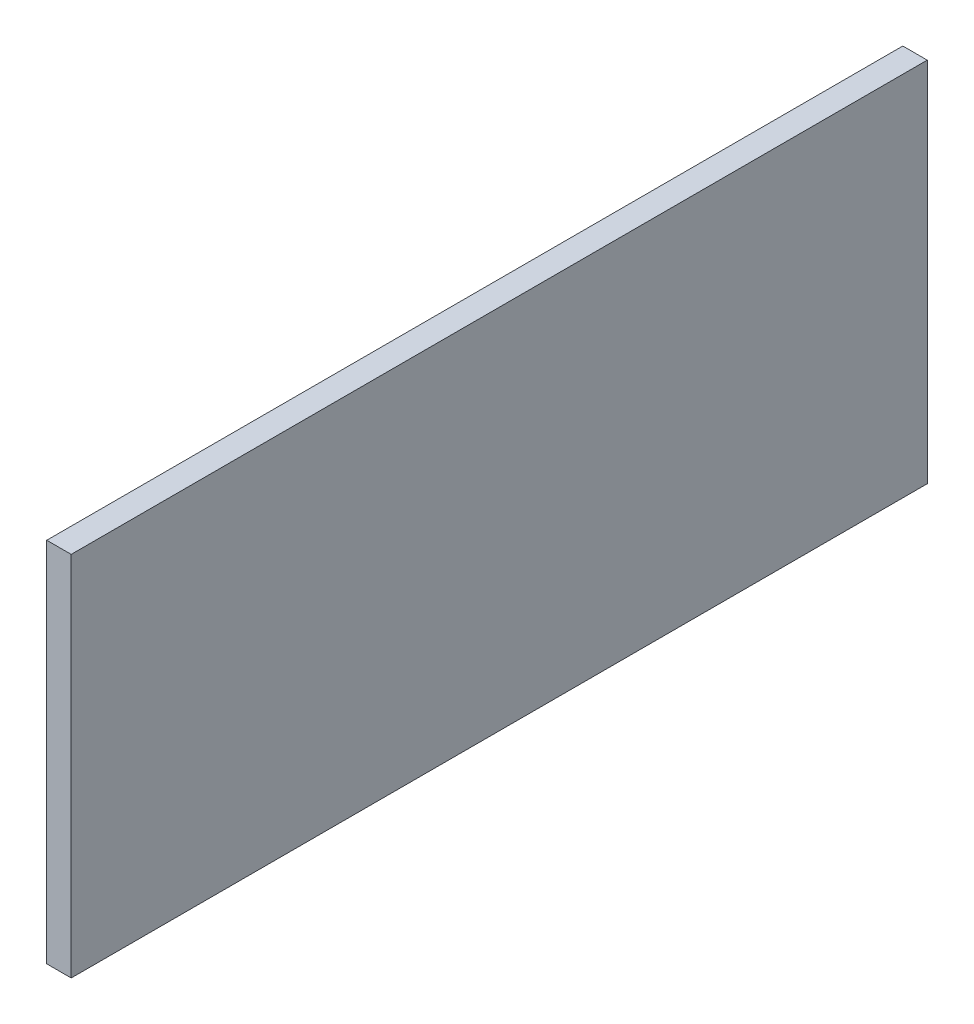
ISO-10303-21;
HEADER;
FILE_DESCRIPTION(('STEP AP214'),'2;1');
FILE_NAME('part.step','',(''),(''),'','','');
FILE_SCHEMA(('AUTOMOTIVE_DESIGN { 1 0 10303 214 1 1 1 1 }'));
ENDSEC;
DATA;
#1=APPLICATION_CONTEXT('core data for automotive mechanical design processes');
#2=APPLICATION_PROTOCOL_DEFINITION('international standard','automotive_design',2000,#1);
#3=PRODUCT_CONTEXT('',#1,'mechanical');
#4=PRODUCT('Part','Part','',(#3));
#5=PRODUCT_RELATED_PRODUCT_CATEGORY('part','',(#4));
#6=PRODUCT_DEFINITION_FORMATION('','',#4);
#7=PRODUCT_DEFINITION_CONTEXT('part definition',#1,'design');
#8=PRODUCT_DEFINITION('design','',#6,#7);
#9=PRODUCT_DEFINITION_SHAPE('','',#8);
#10=(LENGTH_UNIT() NAMED_UNIT(*) SI_UNIT(.MILLI.,.METRE.));
#11=(NAMED_UNIT(*) PLANE_ANGLE_UNIT() SI_UNIT($,.RADIAN.));
#12=(NAMED_UNIT(*) SI_UNIT($,.STERADIAN.) SOLID_ANGLE_UNIT());
#13=UNCERTAINTY_MEASURE_WITH_UNIT(LENGTH_MEASURE(1.E-05),#10,'distance_accuracy_value','');
#14=(GEOMETRIC_REPRESENTATION_CONTEXT(3) GLOBAL_UNCERTAINTY_ASSIGNED_CONTEXT((#13)) GLOBAL_UNIT_ASSIGNED_CONTEXT((#10,
#11,#12)) REPRESENTATION_CONTEXT('',''));
#15=CARTESIAN_POINT('',(0.,0.,0.));
#16=DIRECTION('',(0.,0.,1.));
#17=DIRECTION('',(1.,0.,0.));
#18=AXIS2_PLACEMENT_3D('',#15,#16,#17);
#19=CARTESIAN_POINT('',(2.54,19.05,-44.45));
#20=DIRECTION('',(0.,0.,1.));
#21=DIRECTION('',(1.,0.,0.));
#22=AXIS2_PLACEMENT_3D('',#19,#20,#21);
#23=PLANE('',#22);
#24=DIRECTION('',(0.,1.,0.));
#25=VECTOR('',#24,1.);
#26=CARTESIAN_POINT('',(0.,19.05,-44.45));
#27=LINE('',#26,#25);
#28=CARTESIAN_POINT('',(0.,-19.05,-44.45));
#29=VERTEX_POINT('',#28);
#30=CARTESIAN_POINT('',(0.,19.05,-44.45));
#31=VERTEX_POINT('',#30);
#32=EDGE_CURVE('E101',#29,#31,#27,.T.);
#33=ORIENTED_EDGE('',*,*,#32,.T.);
#34=DIRECTION('',(-1.,0.,0.));
#35=VECTOR('',#34,1.);
#36=CARTESIAN_POINT('',(2.54,19.05,-44.45));
#37=LINE('',#36,#35);
#38=CARTESIAN_POINT('',(2.54,19.05,-44.45));
#39=VERTEX_POINT('',#38);
#40=EDGE_CURVE('E11',#39,#31,#37,.T.);
#41=ORIENTED_EDGE('',*,*,#40,.F.);
#42=DIRECTION('',(0.,1.,0.));
#43=VECTOR('',#42,1.);
#44=CARTESIAN_POINT('',(2.54,19.05,-44.45));
#45=LINE('',#44,#43);
#46=CARTESIAN_POINT('',(2.54,-19.05,-44.45));
#47=VERTEX_POINT('',#46);
#48=EDGE_CURVE('E89',#47,#39,#45,.T.);
#49=ORIENTED_EDGE('',*,*,#48,.F.);
#50=DIRECTION('',(-1.,0.,0.));
#51=VECTOR('',#50,1.);
#52=CARTESIAN_POINT('',(2.54,-19.05,-44.45));
#53=LINE('',#52,#51);
#54=EDGE_CURVE('E97',#47,#29,#53,.T.);
#55=ORIENTED_EDGE('',*,*,#54,.T.);
#56=EDGE_LOOP('',(#33,#41,#49,#55));
#57=FACE_BOUND('',#56,.T.);
#58=ADVANCED_FACE('F38',(#57),#23,.F.);
#59=CARTESIAN_POINT('',(2.54,19.05,44.45));
#60=DIRECTION('',(0.,-1.,0.));
#61=DIRECTION('',(0.,0.,-1.));
#62=AXIS2_PLACEMENT_3D('',#59,#60,#61);
#63=PLANE('',#62);
#64=DIRECTION('',(0.,0.,1.));
#65=VECTOR('',#64,1.);
#66=CARTESIAN_POINT('',(0.,19.05,44.45));
#67=LINE('',#66,#65);
#68=CARTESIAN_POINT('',(0.,19.05,44.45));
#69=VERTEX_POINT('',#68);
#70=EDGE_CURVE('E93',#31,#69,#67,.T.);
#71=ORIENTED_EDGE('',*,*,#70,.T.);
#72=DIRECTION('',(-1.,0.,0.));
#73=VECTOR('',#72,1.);
#74=CARTESIAN_POINT('',(2.54,19.05,44.45));
#75=LINE('',#74,#73);
#76=CARTESIAN_POINT('',(2.54,19.05,44.45));
#77=VERTEX_POINT('',#76);
#78=EDGE_CURVE('E46',#77,#69,#75,.T.);
#79=ORIENTED_EDGE('',*,*,#78,.F.);
#80=DIRECTION('',(0.,0.,1.));
#81=VECTOR('',#80,1.);
#82=CARTESIAN_POINT('',(2.54,19.05,44.45));
#83=LINE('',#82,#81);
#84=EDGE_CURVE('E84',#39,#77,#83,.T.);
#85=ORIENTED_EDGE('',*,*,#84,.F.);
#86=ORIENTED_EDGE('',*,*,#40,.T.);
#87=EDGE_LOOP('',(#71,#79,#85,#86));
#88=FACE_BOUND('',#87,.T.);
#89=ADVANCED_FACE('F92',(#88),#63,.F.);
#90=CARTESIAN_POINT('',(2.54,19.05,44.45));
#91=DIRECTION('',(0.,0.,-1.));
#92=DIRECTION('',(-1.,0.,0.));
#93=AXIS2_PLACEMENT_3D('',#90,#91,#92);
#94=PLANE('',#93);
#95=DIRECTION('',(0.,-1.,0.));
#96=VECTOR('',#95,1.);
#97=CARTESIAN_POINT('',(0.,19.05,44.45));
#98=LINE('',#97,#96);
#99=CARTESIAN_POINT('',(0.,-19.05,44.45));
#100=VERTEX_POINT('',#99);
#101=EDGE_CURVE('E71',#69,#100,#98,.T.);
#102=ORIENTED_EDGE('',*,*,#101,.T.);
#103=DIRECTION('',(-1.,0.,0.));
#104=VECTOR('',#103,1.);
#105=CARTESIAN_POINT('',(2.54,-19.05,44.45));
#106=LINE('',#105,#104);
#107=CARTESIAN_POINT('',(2.54,-19.05,44.45));
#108=VERTEX_POINT('',#107);
#109=EDGE_CURVE('E94',#108,#100,#106,.T.);
#110=ORIENTED_EDGE('',*,*,#109,.F.);
#111=DIRECTION('',(0.,-1.,0.));
#112=VECTOR('',#111,1.);
#113=CARTESIAN_POINT('',(2.54,19.05,44.45));
#114=LINE('',#113,#112);
#115=EDGE_CURVE('E87',#77,#108,#114,.T.);
#116=ORIENTED_EDGE('',*,*,#115,.F.);
#117=ORIENTED_EDGE('',*,*,#78,.T.);
#118=EDGE_LOOP('',(#102,#110,#116,#117));
#119=FACE_BOUND('',#118,.T.);
#120=ADVANCED_FACE('F95',(#119),#94,.F.);
#121=CARTESIAN_POINT('',(2.54,-19.05,44.45));
#122=DIRECTION('',(0.,1.,0.));
#123=DIRECTION('',(0.,0.,1.));
#124=AXIS2_PLACEMENT_3D('',#121,#122,#123);
#125=PLANE('',#124);
#126=DIRECTION('',(0.,0.,-1.));
#127=VECTOR('',#126,1.);
#128=CARTESIAN_POINT('',(0.,-19.05,44.45));
#129=LINE('',#128,#127);
#130=EDGE_CURVE('E77',#100,#29,#129,.T.);
#131=ORIENTED_EDGE('',*,*,#130,.T.);
#132=ORIENTED_EDGE('',*,*,#54,.F.);
#133=DIRECTION('',(0.,0.,-1.));
#134=VECTOR('',#133,1.);
#135=CARTESIAN_POINT('',(2.54,-19.05,44.45));
#136=LINE('',#135,#134);
#137=EDGE_CURVE('E54',#108,#47,#136,.T.);
#138=ORIENTED_EDGE('',*,*,#137,.F.);
#139=ORIENTED_EDGE('',*,*,#109,.T.);
#140=EDGE_LOOP('',(#131,#132,#138,#139));
#141=FACE_BOUND('',#140,.T.);
#142=ADVANCED_FACE('F108',(#141),#125,.F.);
#143=CARTESIAN_POINT('',(2.54,0.,0.));
#144=DIRECTION('',(1.,0.,0.));
#145=DIRECTION('',(0.,0.,-1.));
#146=AXIS2_PLACEMENT_3D('',#143,#144,#145);
#147=PLANE('',#146);
#148=ORIENTED_EDGE('',*,*,#48,.T.);
#149=ORIENTED_EDGE('',*,*,#84,.T.);
#150=ORIENTED_EDGE('',*,*,#115,.T.);
#151=ORIENTED_EDGE('',*,*,#137,.T.);
#152=EDGE_LOOP('',(#148,#149,#150,#151));
#153=FACE_BOUND('',#152,.T.);
#154=ADVANCED_FACE('F85',(#153),#147,.T.);
#155=CARTESIAN_POINT('',(0.,0.,0.));
#156=DIRECTION('',(1.,0.,0.));
#157=DIRECTION('',(0.,0.,-1.));
#158=AXIS2_PLACEMENT_3D('',#155,#156,#157);
#159=PLANE('',#158);
#160=ORIENTED_EDGE('',*,*,#32,.F.);
#161=ORIENTED_EDGE('',*,*,#130,.F.);
#162=ORIENTED_EDGE('',*,*,#101,.F.);
#163=ORIENTED_EDGE('',*,*,#70,.F.);
#164=EDGE_LOOP('',(#160,#161,#162,#163));
#165=FACE_BOUND('',#164,.T.);
#166=ADVANCED_FACE('F111',(#165),#159,.F.);
#167=CLOSED_SHELL('',(#58,#89,#120,#142,#154,#166));
#168=MANIFOLD_SOLID_BREP('B2',#167);
#169=ADVANCED_BREP_SHAPE_REPRESENTATION('',(#18,#168),#14);
#170=SHAPE_DEFINITION_REPRESENTATION(#9,#169);
ENDSEC;
END-ISO-10303-21;
